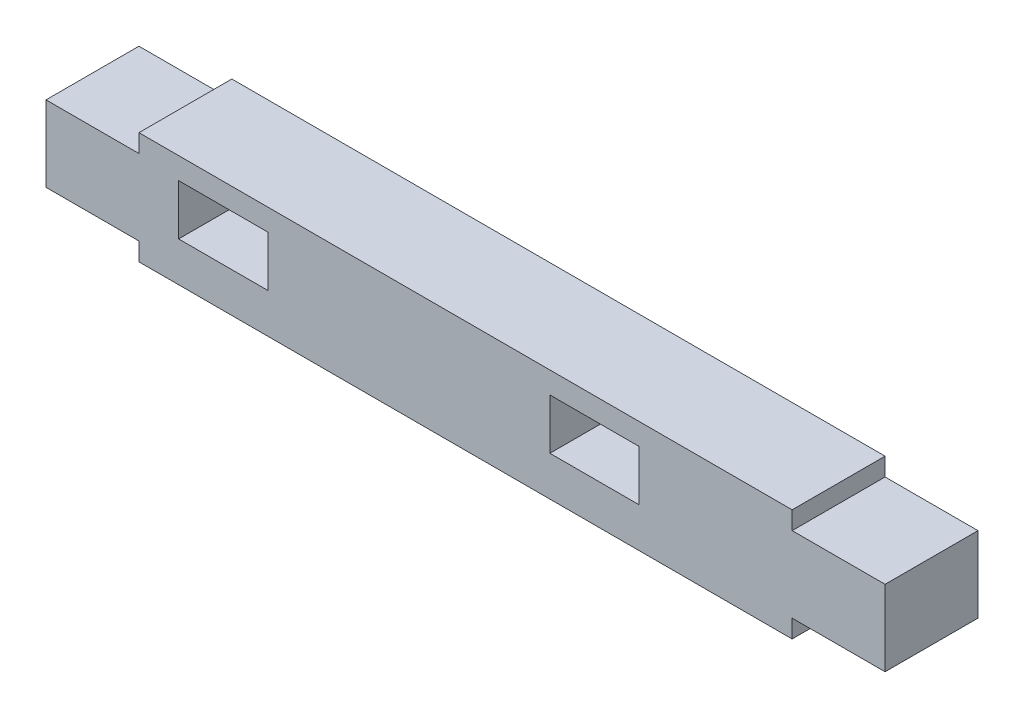
ISO-10303-21;
HEADER;
FILE_DESCRIPTION(('STEP AP214'),'2;1');
FILE_NAME('part.step','',(''),(''),'','','');
FILE_SCHEMA(('AUTOMOTIVE_DESIGN { 1 0 10303 214 1 1 1 1 }'));
ENDSEC;
DATA;
#1=APPLICATION_CONTEXT('core data for automotive mechanical design processes');
#2=APPLICATION_PROTOCOL_DEFINITION('international standard','automotive_design',2000,#1);
#3=PRODUCT_CONTEXT('',#1,'mechanical');
#4=PRODUCT('Part','Part','',(#3));
#5=PRODUCT_RELATED_PRODUCT_CATEGORY('part','',(#4));
#6=PRODUCT_DEFINITION_FORMATION('','',#4);
#7=PRODUCT_DEFINITION_CONTEXT('part definition',#1,'design');
#8=PRODUCT_DEFINITION('design','',#6,#7);
#9=PRODUCT_DEFINITION_SHAPE('','',#8);
#10=(LENGTH_UNIT() NAMED_UNIT(*) SI_UNIT(.MILLI.,.METRE.));
#11=(NAMED_UNIT(*) PLANE_ANGLE_UNIT() SI_UNIT($,.RADIAN.));
#12=(NAMED_UNIT(*) SI_UNIT($,.STERADIAN.) SOLID_ANGLE_UNIT());
#13=UNCERTAINTY_MEASURE_WITH_UNIT(LENGTH_MEASURE(1.E-05),#10,'distance_accuracy_value','');
#14=(GEOMETRIC_REPRESENTATION_CONTEXT(3) GLOBAL_UNCERTAINTY_ASSIGNED_CONTEXT((#13)) GLOBAL_UNIT_ASSIGNED_CONTEXT((#10,
#11,#12)) REPRESENTATION_CONTEXT('',''));
#15=CARTESIAN_POINT('',(0.,0.,0.));
#16=DIRECTION('',(0.,0.,1.));
#17=DIRECTION('',(1.,0.,0.));
#18=AXIS2_PLACEMENT_3D('',#15,#16,#17);
#19=CARTESIAN_POINT('',(-18.1,6.1,5.15));
#20=DIRECTION('',(1.,0.,0.));
#21=DIRECTION('',(0.,0.,-1.));
#22=AXIS2_PLACEMENT_3D('',#19,#20,#21);
#23=PLANE('',#22);
#24=DIRECTION('',(0.,-1.,0.));
#25=VECTOR('',#24,1.);
#26=CARTESIAN_POINT('',(-18.1,6.1,0.));
#27=LINE('',#26,#25);
#28=CARTESIAN_POINT('',(-18.1,6.1,0.));
#29=VERTEX_POINT('',#28);
#30=CARTESIAN_POINT('',(-18.1,5.1,0.));
#31=VERTEX_POINT('',#30);
#32=EDGE_CURVE('E248',#29,#31,#27,.T.);
#33=ORIENTED_EDGE('',*,*,#32,.T.);
#34=DIRECTION('',(0.,0.,-1.));
#35=VECTOR('',#34,1.);
#36=CARTESIAN_POINT('',(-18.1,5.1,5.15));
#37=LINE('',#36,#35);
#38=CARTESIAN_POINT('',(-18.1,5.1,5.15));
#39=VERTEX_POINT('',#38);
#40=EDGE_CURVE('E12',#39,#31,#37,.T.);
#41=ORIENTED_EDGE('',*,*,#40,.F.);
#42=DIRECTION('',(0.,-1.,0.));
#43=VECTOR('',#42,1.);
#44=CARTESIAN_POINT('',(-18.1,6.1,5.15));
#45=LINE('',#44,#43);
#46=CARTESIAN_POINT('',(-18.1,6.1,5.15));
#47=VERTEX_POINT('',#46);
#48=EDGE_CURVE('E255',#47,#39,#45,.T.);
#49=ORIENTED_EDGE('',*,*,#48,.F.);
#50=DIRECTION('',(0.,0.,-1.));
#51=VECTOR('',#50,1.);
#52=CARTESIAN_POINT('',(-18.1,6.1,5.15));
#53=LINE('',#52,#51);
#54=EDGE_CURVE('E301',#47,#29,#53,.T.);
#55=ORIENTED_EDGE('',*,*,#54,.T.);
#56=EDGE_LOOP('',(#33,#41,#49,#55));
#57=FACE_BOUND('',#56,.T.);
#58=ADVANCED_FACE('F36',(#57),#23,.F.);
#59=CARTESIAN_POINT('',(-18.1,5.1,5.15));
#60=DIRECTION('',(0.,-1.,0.));
#61=DIRECTION('',(0.,0.,-1.));
#62=AXIS2_PLACEMENT_3D('',#59,#60,#61);
#63=PLANE('',#62);
#64=DIRECTION('',(-1.,0.,0.));
#65=VECTOR('',#64,1.);
#66=CARTESIAN_POINT('',(-18.1,5.1,0.));
#67=LINE('',#66,#65);
#68=CARTESIAN_POINT('',(-23.25,5.1,0.));
#69=VERTEX_POINT('',#68);
#70=EDGE_CURVE('E304',#31,#69,#67,.T.);
#71=ORIENTED_EDGE('',*,*,#70,.T.);
#72=DIRECTION('',(0.,0.,-1.));
#73=VECTOR('',#72,1.);
#74=CARTESIAN_POINT('',(-23.25,5.1,5.15));
#75=LINE('',#74,#73);
#76=CARTESIAN_POINT('',(-23.25,5.1,5.15));
#77=VERTEX_POINT('',#76);
#78=EDGE_CURVE('E43',#77,#69,#75,.T.);
#79=ORIENTED_EDGE('',*,*,#78,.F.);
#80=DIRECTION('',(-1.,0.,0.));
#81=VECTOR('',#80,1.);
#82=CARTESIAN_POINT('',(-18.1,5.1,5.15));
#83=LINE('',#82,#81);
#84=EDGE_CURVE('E259',#39,#77,#83,.T.);
#85=ORIENTED_EDGE('',*,*,#84,.F.);
#86=ORIENTED_EDGE('',*,*,#40,.T.);
#87=EDGE_LOOP('',(#71,#79,#85,#86));
#88=FACE_BOUND('',#87,.T.);
#89=ADVANCED_FACE('F380',(#88),#63,.F.);
#90=CARTESIAN_POINT('',(-23.25,5.1,5.15));
#91=DIRECTION('',(1.,0.,0.));
#92=DIRECTION('',(0.,0.,-1.));
#93=AXIS2_PLACEMENT_3D('',#90,#91,#92);
#94=PLANE('',#93);
#95=DIRECTION('',(0.,-1.,0.));
#96=VECTOR('',#95,1.);
#97=CARTESIAN_POINT('',(-23.25,5.1,0.));
#98=LINE('',#97,#96);
#99=CARTESIAN_POINT('',(-23.25,0.899999999999995,0.));
#100=VERTEX_POINT('',#99);
#101=EDGE_CURVE('E306',#69,#100,#98,.T.);
#102=ORIENTED_EDGE('',*,*,#101,.T.);
#103=DIRECTION('',(0.,0.,-1.));
#104=VECTOR('',#103,1.);
#105=CARTESIAN_POINT('',(-23.25,0.899999999999995,5.15));
#106=LINE('',#105,#104);
#107=CARTESIAN_POINT('',(-23.25,0.899999999999995,5.15));
#108=VERTEX_POINT('',#107);
#109=EDGE_CURVE('E351',#108,#100,#106,.T.);
#110=ORIENTED_EDGE('',*,*,#109,.F.);
#111=DIRECTION('',(0.,-1.,0.));
#112=VECTOR('',#111,1.);
#113=CARTESIAN_POINT('',(-23.25,5.1,5.15));
#114=LINE('',#113,#112);
#115=EDGE_CURVE('E268',#77,#108,#114,.T.);
#116=ORIENTED_EDGE('',*,*,#115,.F.);
#117=ORIENTED_EDGE('',*,*,#78,.T.);
#118=EDGE_LOOP('',(#102,#110,#116,#117));
#119=FACE_BOUND('',#118,.T.);
#120=ADVANCED_FACE('F358',(#119),#94,.F.);
#121=CARTESIAN_POINT('',(-23.25,0.899999999999995,5.15));
#122=DIRECTION('',(0.,1.,0.));
#123=DIRECTION('',(-1.,0.,0.));
#124=AXIS2_PLACEMENT_3D('',#121,#122,#123);
#125=PLANE('',#124);
#126=DIRECTION('',(1.,0.,0.));
#127=VECTOR('',#126,1.);
#128=CARTESIAN_POINT('',(-23.25,0.899999999999995,0.));
#129=LINE('',#128,#127);
#130=CARTESIAN_POINT('',(-18.1,0.899999999999995,0.));
#131=VERTEX_POINT('',#130);
#132=EDGE_CURVE('E308',#100,#131,#129,.T.);
#133=ORIENTED_EDGE('',*,*,#132,.T.);
#134=DIRECTION('',(0.,0.,-1.));
#135=VECTOR('',#134,1.);
#136=CARTESIAN_POINT('',(-18.1,0.899999999999995,5.15));
#137=LINE('',#136,#135);
#138=CARTESIAN_POINT('',(-18.1,0.899999999999995,5.15));
#139=VERTEX_POINT('',#138);
#140=EDGE_CURVE('E348',#139,#131,#137,.T.);
#141=ORIENTED_EDGE('',*,*,#140,.F.);
#142=DIRECTION('',(1.,0.,0.));
#143=VECTOR('',#142,1.);
#144=CARTESIAN_POINT('',(-23.25,0.899999999999995,5.15));
#145=LINE('',#144,#143);
#146=EDGE_CURVE('E270',#108,#139,#145,.T.);
#147=ORIENTED_EDGE('',*,*,#146,.F.);
#148=ORIENTED_EDGE('',*,*,#109,.T.);
#149=EDGE_LOOP('',(#133,#141,#147,#148));
#150=FACE_BOUND('',#149,.T.);
#151=ADVANCED_FACE('F368',(#150),#125,.F.);
#152=CARTESIAN_POINT('',(-18.1,0.899999999999995,5.15));
#153=DIRECTION('',(1.,0.,0.));
#154=DIRECTION('',(0.,0.,-1.));
#155=AXIS2_PLACEMENT_3D('',#152,#153,#154);
#156=PLANE('',#155);
#157=DIRECTION('',(0.,-1.,0.));
#158=VECTOR('',#157,1.);
#159=CARTESIAN_POINT('',(-18.1,0.899999999999995,0.));
#160=LINE('',#159,#158);
#161=CARTESIAN_POINT('',(-18.1,-0.1,0.));
#162=VERTEX_POINT('',#161);
#163=EDGE_CURVE('E310',#131,#162,#160,.T.);
#164=ORIENTED_EDGE('',*,*,#163,.T.);
#165=DIRECTION('',(0.,0.,-1.));
#166=VECTOR('',#165,1.);
#167=CARTESIAN_POINT('',(-18.1,-0.1,5.15));
#168=LINE('',#167,#166);
#169=CARTESIAN_POINT('',(-18.1,-0.1,5.15));
#170=VERTEX_POINT('',#169);
#171=EDGE_CURVE('E345',#170,#162,#168,.T.);
#172=ORIENTED_EDGE('',*,*,#171,.F.);
#173=DIRECTION('',(0.,-1.,0.));
#174=VECTOR('',#173,1.);
#175=CARTESIAN_POINT('',(-18.1,0.899999999999995,5.15));
#176=LINE('',#175,#174);
#177=EDGE_CURVE('E273',#139,#170,#176,.T.);
#178=ORIENTED_EDGE('',*,*,#177,.F.);
#179=ORIENTED_EDGE('',*,*,#140,.T.);
#180=EDGE_LOOP('',(#164,#172,#178,#179));
#181=FACE_BOUND('',#180,.T.);
#182=ADVANCED_FACE('F372',(#181),#156,.F.);
#183=CARTESIAN_POINT('',(18.1,-0.1,5.15));
#184=DIRECTION('',(0.,1.,0.));
#185=DIRECTION('',(-1.,0.,0.));
#186=AXIS2_PLACEMENT_3D('',#183,#184,#185);
#187=PLANE('',#186);
#188=DIRECTION('',(1.,0.,0.));
#189=VECTOR('',#188,1.);
#190=CARTESIAN_POINT('',(18.1,-0.1,0.));
#191=LINE('',#190,#189);
#192=CARTESIAN_POINT('',(18.1,-0.1,0.));
#193=VERTEX_POINT('',#192);
#194=EDGE_CURVE('E312',#162,#193,#191,.T.);
#195=ORIENTED_EDGE('',*,*,#194,.T.);
#196=DIRECTION('',(0.,0.,-1.));
#197=VECTOR('',#196,1.);
#198=CARTESIAN_POINT('',(18.1,-0.1,5.15));
#199=LINE('',#198,#197);
#200=CARTESIAN_POINT('',(18.1,-0.1,5.15));
#201=VERTEX_POINT('',#200);
#202=EDGE_CURVE('E342',#201,#193,#199,.T.);
#203=ORIENTED_EDGE('',*,*,#202,.F.);
#204=DIRECTION('',(1.,0.,0.));
#205=VECTOR('',#204,1.);
#206=CARTESIAN_POINT('',(18.1,-0.1,5.15));
#207=LINE('',#206,#205);
#208=EDGE_CURVE('E276',#170,#201,#207,.T.);
#209=ORIENTED_EDGE('',*,*,#208,.F.);
#210=ORIENTED_EDGE('',*,*,#171,.T.);
#211=EDGE_LOOP('',(#195,#203,#209,#210));
#212=FACE_BOUND('',#211,.T.);
#213=ADVANCED_FACE('F413',(#212),#187,.F.);
#214=CARTESIAN_POINT('',(18.1,0.9,5.15));
#215=DIRECTION('',(-1.,0.,0.));
#216=DIRECTION('',(0.,0.,1.));
#217=AXIS2_PLACEMENT_3D('',#214,#215,#216);
#218=PLANE('',#217);
#219=DIRECTION('',(0.,1.,0.));
#220=VECTOR('',#219,1.);
#221=CARTESIAN_POINT('',(18.1,0.9,0.));
#222=LINE('',#221,#220);
#223=CARTESIAN_POINT('',(18.1,0.9,0.));
#224=VERTEX_POINT('',#223);
#225=EDGE_CURVE('E314',#193,#224,#222,.T.);
#226=ORIENTED_EDGE('',*,*,#225,.T.);
#227=DIRECTION('',(0.,0.,-1.));
#228=VECTOR('',#227,1.);
#229=CARTESIAN_POINT('',(18.1,0.9,5.15));
#230=LINE('',#229,#228);
#231=CARTESIAN_POINT('',(18.1,0.9,5.15));
#232=VERTEX_POINT('',#231);
#233=EDGE_CURVE('E339',#232,#224,#230,.T.);
#234=ORIENTED_EDGE('',*,*,#233,.F.);
#235=DIRECTION('',(0.,1.,0.));
#236=VECTOR('',#235,1.);
#237=CARTESIAN_POINT('',(18.1,0.9,5.15));
#238=LINE('',#237,#236);
#239=EDGE_CURVE('E284',#201,#232,#238,.T.);
#240=ORIENTED_EDGE('',*,*,#239,.F.);
#241=ORIENTED_EDGE('',*,*,#202,.T.);
#242=EDGE_LOOP('',(#226,#234,#240,#241));
#243=FACE_BOUND('',#242,.T.);
#244=ADVANCED_FACE('F411',(#243),#218,.F.);
#245=CARTESIAN_POINT('',(23.25,0.9,5.15));
#246=DIRECTION('',(0.,1.,0.));
#247=DIRECTION('',(0.,0.,1.));
#248=AXIS2_PLACEMENT_3D('',#245,#246,#247);
#249=PLANE('',#248);
#250=DIRECTION('',(1.,0.,0.));
#251=VECTOR('',#250,1.);
#252=CARTESIAN_POINT('',(23.25,0.9,0.));
#253=LINE('',#252,#251);
#254=CARTESIAN_POINT('',(23.25,0.9,0.));
#255=VERTEX_POINT('',#254);
#256=EDGE_CURVE('E316',#224,#255,#253,.T.);
#257=ORIENTED_EDGE('',*,*,#256,.T.);
#258=DIRECTION('',(0.,0.,-1.));
#259=VECTOR('',#258,1.);
#260=CARTESIAN_POINT('',(23.25,0.9,5.15));
#261=LINE('',#260,#259);
#262=CARTESIAN_POINT('',(23.25,0.9,5.15));
#263=VERTEX_POINT('',#262);
#264=EDGE_CURVE('E336',#263,#255,#261,.T.);
#265=ORIENTED_EDGE('',*,*,#264,.F.);
#266=DIRECTION('',(1.,0.,0.));
#267=VECTOR('',#266,1.);
#268=CARTESIAN_POINT('',(23.25,0.9,5.15));
#269=LINE('',#268,#267);
#270=EDGE_CURVE('E286',#232,#263,#269,.T.);
#271=ORIENTED_EDGE('',*,*,#270,.F.);
#272=ORIENTED_EDGE('',*,*,#233,.T.);
#273=EDGE_LOOP('',(#257,#265,#271,#272));
#274=FACE_BOUND('',#273,.T.);
#275=ADVANCED_FACE('F407',(#274),#249,.F.);
#276=CARTESIAN_POINT('',(23.25,5.1,5.15));
#277=DIRECTION('',(-1.,0.,0.));
#278=DIRECTION('',(0.,0.,1.));
#279=AXIS2_PLACEMENT_3D('',#276,#277,#278);
#280=PLANE('',#279);
#281=DIRECTION('',(0.,1.,0.));
#282=VECTOR('',#281,1.);
#283=CARTESIAN_POINT('',(23.25,5.1,0.));
#284=LINE('',#283,#282);
#285=CARTESIAN_POINT('',(23.25,5.1,0.));
#286=VERTEX_POINT('',#285);
#287=EDGE_CURVE('E318',#255,#286,#284,.T.);
#288=ORIENTED_EDGE('',*,*,#287,.T.);
#289=DIRECTION('',(0.,0.,-1.));
#290=VECTOR('',#289,1.);
#291=CARTESIAN_POINT('',(23.25,5.1,5.15));
#292=LINE('',#291,#290);
#293=CARTESIAN_POINT('',(23.25,5.1,5.15));
#294=VERTEX_POINT('',#293);
#295=EDGE_CURVE('E333',#294,#286,#292,.T.);
#296=ORIENTED_EDGE('',*,*,#295,.F.);
#297=DIRECTION('',(0.,1.,0.));
#298=VECTOR('',#297,1.);
#299=CARTESIAN_POINT('',(23.25,5.1,5.15));
#300=LINE('',#299,#298);
#301=EDGE_CURVE('E289',#263,#294,#300,.T.);
#302=ORIENTED_EDGE('',*,*,#301,.F.);
#303=ORIENTED_EDGE('',*,*,#264,.T.);
#304=EDGE_LOOP('',(#288,#296,#302,#303));
#305=FACE_BOUND('',#304,.T.);
#306=ADVANCED_FACE('F402',(#305),#280,.F.);
#307=CARTESIAN_POINT('',(18.1,5.1,5.15));
#308=DIRECTION('',(0.,-1.,0.));
#309=DIRECTION('',(0.,0.,-1.));
#310=AXIS2_PLACEMENT_3D('',#307,#308,#309);
#311=PLANE('',#310);
#312=DIRECTION('',(-1.,0.,0.));
#313=VECTOR('',#312,1.);
#314=CARTESIAN_POINT('',(18.1,5.1,0.));
#315=LINE('',#314,#313);
#316=CARTESIAN_POINT('',(18.1,5.1,0.));
#317=VERTEX_POINT('',#316);
#318=EDGE_CURVE('E320',#286,#317,#315,.T.);
#319=ORIENTED_EDGE('',*,*,#318,.T.);
#320=DIRECTION('',(0.,0.,-1.));
#321=VECTOR('',#320,1.);
#322=CARTESIAN_POINT('',(18.1,5.1,5.15));
#323=LINE('',#322,#321);
#324=CARTESIAN_POINT('',(18.1,5.1,5.15));
#325=VERTEX_POINT('',#324);
#326=EDGE_CURVE('E330',#325,#317,#323,.T.);
#327=ORIENTED_EDGE('',*,*,#326,.F.);
#328=DIRECTION('',(-1.,0.,0.));
#329=VECTOR('',#328,1.);
#330=CARTESIAN_POINT('',(18.1,5.1,5.15));
#331=LINE('',#330,#329);
#332=EDGE_CURVE('E292',#294,#325,#331,.T.);
#333=ORIENTED_EDGE('',*,*,#332,.F.);
#334=ORIENTED_EDGE('',*,*,#295,.T.);
#335=EDGE_LOOP('',(#319,#327,#333,#334));
#336=FACE_BOUND('',#335,.T.);
#337=ADVANCED_FACE('F396',(#336),#311,.F.);
#338=CARTESIAN_POINT('',(18.1,6.1,5.15));
#339=DIRECTION('',(-1.,0.,0.));
#340=DIRECTION('',(0.,0.,1.));
#341=AXIS2_PLACEMENT_3D('',#338,#339,#340);
#342=PLANE('',#341);
#343=DIRECTION('',(0.,1.,0.));
#344=VECTOR('',#343,1.);
#345=CARTESIAN_POINT('',(18.1,6.1,0.));
#346=LINE('',#345,#344);
#347=CARTESIAN_POINT('',(18.1,6.1,0.));
#348=VERTEX_POINT('',#347);
#349=EDGE_CURVE('E322',#317,#348,#346,.T.);
#350=ORIENTED_EDGE('',*,*,#349,.T.);
#351=DIRECTION('',(0.,0.,-1.));
#352=VECTOR('',#351,1.);
#353=CARTESIAN_POINT('',(18.1,6.1,5.15));
#354=LINE('',#353,#352);
#355=CARTESIAN_POINT('',(18.1,6.1,5.15));
#356=VERTEX_POINT('',#355);
#357=EDGE_CURVE('E327',#356,#348,#354,.T.);
#358=ORIENTED_EDGE('',*,*,#357,.F.);
#359=DIRECTION('',(0.,1.,0.));
#360=VECTOR('',#359,1.);
#361=CARTESIAN_POINT('',(18.1,6.1,5.15));
#362=LINE('',#361,#360);
#363=EDGE_CURVE('E296',#325,#356,#362,.T.);
#364=ORIENTED_EDGE('',*,*,#363,.F.);
#365=ORIENTED_EDGE('',*,*,#326,.T.);
#366=EDGE_LOOP('',(#350,#358,#364,#365));
#367=FACE_BOUND('',#366,.T.);
#368=ADVANCED_FACE('F392',(#367),#342,.F.);
#369=CARTESIAN_POINT('',(-18.1,6.1,5.15));
#370=DIRECTION('',(0.,-1.,0.));
#371=DIRECTION('',(0.,0.,-1.));
#372=AXIS2_PLACEMENT_3D('',#369,#370,#371);
#373=PLANE('',#372);
#374=DIRECTION('',(-1.,0.,0.));
#375=VECTOR('',#374,1.);
#376=CARTESIAN_POINT('',(-18.1,6.1,0.));
#377=LINE('',#376,#375);
#378=EDGE_CURVE('E260',#348,#29,#377,.T.);
#379=ORIENTED_EDGE('',*,*,#378,.T.);
#380=ORIENTED_EDGE('',*,*,#54,.F.);
#381=DIRECTION('',(-1.,0.,0.));
#382=VECTOR('',#381,1.);
#383=CARTESIAN_POINT('',(-18.1,6.1,5.15));
#384=LINE('',#383,#382);
#385=EDGE_CURVE('E298',#356,#47,#384,.T.);
#386=ORIENTED_EDGE('',*,*,#385,.F.);
#387=ORIENTED_EDGE('',*,*,#357,.T.);
#388=EDGE_LOOP('',(#379,#380,#386,#387));
#389=FACE_BOUND('',#388,.T.);
#390=ADVANCED_FACE('F387',(#389),#373,.F.);
#391=CARTESIAN_POINT('',(-18.1,5.1,5.15));
#392=DIRECTION('',(0.,0.,-1.));
#393=DIRECTION('',(-1.,0.,0.));
#394=AXIS2_PLACEMENT_3D('',#391,#392,#393);
#395=PLANE('',#394);
#396=DIRECTION('',(1.,0.,0.));
#397=VECTOR('',#396,1.);
#398=CARTESIAN_POINT('',(-15.9,2.1,5.15));
#399=LINE('',#398,#397);
#400=CARTESIAN_POINT('',(-15.9,2.1,5.15));
#401=VERTEX_POINT('',#400);
#402=CARTESIAN_POINT('',(-10.95,2.1,5.15));
#403=VERTEX_POINT('',#402);
#404=EDGE_CURVE('E200',#401,#403,#399,.T.);
#405=ORIENTED_EDGE('',*,*,#404,.F.);
#406=DIRECTION('',(0.,-1.,0.));
#407=VECTOR('',#406,1.);
#408=CARTESIAN_POINT('',(-15.9,4.9,5.15));
#409=LINE('',#408,#407);
#410=CARTESIAN_POINT('',(-15.9,4.9,5.15));
#411=VERTEX_POINT('',#410);
#412=EDGE_CURVE('E50',#411,#401,#409,.T.);
#413=ORIENTED_EDGE('',*,*,#412,.F.);
#414=DIRECTION('',(-1.,0.,0.));
#415=VECTOR('',#414,1.);
#416=CARTESIAN_POINT('',(-15.9,4.9,5.15));
#417=LINE('',#416,#415);
#418=CARTESIAN_POINT('',(-10.95,4.9,5.15));
#419=VERTEX_POINT('',#418);
#420=EDGE_CURVE('E190',#419,#411,#417,.T.);
#421=ORIENTED_EDGE('',*,*,#420,.F.);
#422=DIRECTION('',(0.,1.,0.));
#423=VECTOR('',#422,1.);
#424=CARTESIAN_POINT('',(-10.95,4.9,5.15));
#425=LINE('',#424,#423);
#426=EDGE_CURVE('E193',#403,#419,#425,.T.);
#427=ORIENTED_EDGE('',*,*,#426,.F.);
#428=EDGE_LOOP('',(#405,#413,#421,#427));
#429=FACE_BOUND('',#428,.T.);
#430=DIRECTION('',(1.,0.,0.));
#431=VECTOR('',#430,1.);
#432=CARTESIAN_POINT('',(4.675,2.1,5.15));
#433=LINE('',#432,#431);
#434=CARTESIAN_POINT('',(4.675,2.1,5.15));
#435=VERTEX_POINT('',#434);
#436=CARTESIAN_POINT('',(9.625,2.1,5.15));
#437=VERTEX_POINT('',#436);
#438=EDGE_CURVE('E233',#435,#437,#433,.T.);
#439=ORIENTED_EDGE('',*,*,#438,.F.);
#440=DIRECTION('',(0.,-1.,0.));
#441=VECTOR('',#440,1.);
#442=CARTESIAN_POINT('',(4.675,4.9,5.15));
#443=LINE('',#442,#441);
#444=CARTESIAN_POINT('',(4.675,4.9,5.15));
#445=VERTEX_POINT('',#444);
#446=EDGE_CURVE('E213',#445,#435,#443,.T.);
#447=ORIENTED_EDGE('',*,*,#446,.F.);
#448=DIRECTION('',(-1.,0.,0.));
#449=VECTOR('',#448,1.);
#450=CARTESIAN_POINT('',(4.675,4.9,5.15));
#451=LINE('',#450,#449);
#452=CARTESIAN_POINT('',(9.625,4.9,5.15));
#453=VERTEX_POINT('',#452);
#454=EDGE_CURVE('E221',#453,#445,#451,.T.);
#455=ORIENTED_EDGE('',*,*,#454,.F.);
#456=DIRECTION('',(0.,1.,0.));
#457=VECTOR('',#456,1.);
#458=CARTESIAN_POINT('',(9.625,4.9,5.15));
#459=LINE('',#458,#457);
#460=EDGE_CURVE('E244',#437,#453,#459,.T.);
#461=ORIENTED_EDGE('',*,*,#460,.F.);
#462=EDGE_LOOP('',(#439,#447,#455,#461));
#463=FACE_BOUND('',#462,.T.);
#464=ORIENTED_EDGE('',*,*,#48,.T.);
#465=ORIENTED_EDGE('',*,*,#84,.T.);
#466=ORIENTED_EDGE('',*,*,#115,.T.);
#467=ORIENTED_EDGE('',*,*,#146,.T.);
#468=ORIENTED_EDGE('',*,*,#177,.T.);
#469=ORIENTED_EDGE('',*,*,#208,.T.);
#470=ORIENTED_EDGE('',*,*,#239,.T.);
#471=ORIENTED_EDGE('',*,*,#270,.T.);
#472=ORIENTED_EDGE('',*,*,#301,.T.);
#473=ORIENTED_EDGE('',*,*,#332,.T.);
#474=ORIENTED_EDGE('',*,*,#363,.T.);
#475=ORIENTED_EDGE('',*,*,#385,.T.);
#476=EDGE_LOOP('',(#464,#465,#466,#467,#468,#469,#470,#471,#472,#473,#474,#475));
#477=FACE_BOUND('',#476,.T.);
#478=ADVANCED_FACE('F376',(#429,#463,#477),#395,.F.);
#479=CARTESIAN_POINT('',(-18.1,5.1,0.));
#480=DIRECTION('',(0.,0.,-1.));
#481=DIRECTION('',(-1.,0.,0.));
#482=AXIS2_PLACEMENT_3D('',#479,#480,#481);
#483=PLANE('',#482);
#484=DIRECTION('',(0.,-1.,0.));
#485=VECTOR('',#484,1.);
#486=CARTESIAN_POINT('',(-15.9,4.9,0.));
#487=LINE('',#486,#485);
#488=CARTESIAN_POINT('',(-15.9,4.9,0.));
#489=VERTEX_POINT('',#488);
#490=CARTESIAN_POINT('',(-15.9,2.1,0.));
#491=VERTEX_POINT('',#490);
#492=EDGE_CURVE('E174',#489,#491,#487,.T.);
#493=ORIENTED_EDGE('',*,*,#492,.T.);
#494=DIRECTION('',(1.,0.,0.));
#495=VECTOR('',#494,1.);
#496=CARTESIAN_POINT('',(-15.9,2.1,0.));
#497=LINE('',#496,#495);
#498=CARTESIAN_POINT('',(-10.95,2.1,0.));
#499=VERTEX_POINT('',#498);
#500=EDGE_CURVE('E183',#491,#499,#497,.T.);
#501=ORIENTED_EDGE('',*,*,#500,.T.);
#502=DIRECTION('',(0.,1.,0.));
#503=VECTOR('',#502,1.);
#504=CARTESIAN_POINT('',(-10.95,4.9,0.));
#505=LINE('',#504,#503);
#506=CARTESIAN_POINT('',(-10.95,4.9,0.));
#507=VERTEX_POINT('',#506);
#508=EDGE_CURVE('E58',#499,#507,#505,.T.);
#509=ORIENTED_EDGE('',*,*,#508,.T.);
#510=DIRECTION('',(-1.,0.,0.));
#511=VECTOR('',#510,1.);
#512=CARTESIAN_POINT('',(-15.9,4.9,0.));
#513=LINE('',#512,#511);
#514=EDGE_CURVE('E180',#507,#489,#513,.T.);
#515=ORIENTED_EDGE('',*,*,#514,.T.);
#516=EDGE_LOOP('',(#493,#501,#509,#515));
#517=FACE_BOUND('',#516,.T.);
#518=DIRECTION('',(0.,-1.,0.));
#519=VECTOR('',#518,1.);
#520=CARTESIAN_POINT('',(4.675,4.9,0.));
#521=LINE('',#520,#519);
#522=CARTESIAN_POINT('',(4.675,4.9,0.));
#523=VERTEX_POINT('',#522);
#524=CARTESIAN_POINT('',(4.675,2.1,0.));
#525=VERTEX_POINT('',#524);
#526=EDGE_CURVE('E217',#523,#525,#521,.T.);
#527=ORIENTED_EDGE('',*,*,#526,.T.);
#528=DIRECTION('',(1.,0.,0.));
#529=VECTOR('',#528,1.);
#530=CARTESIAN_POINT('',(4.675,2.1,0.));
#531=LINE('',#530,#529);
#532=CARTESIAN_POINT('',(9.62499999999999,2.1,0.));
#533=VERTEX_POINT('',#532);
#534=EDGE_CURVE('E220',#525,#533,#531,.T.);
#535=ORIENTED_EDGE('',*,*,#534,.T.);
#536=DIRECTION('',(0.,1.,0.));
#537=VECTOR('',#536,1.);
#538=CARTESIAN_POINT('',(9.625,4.9,0.));
#539=LINE('',#538,#537);
#540=CARTESIAN_POINT('',(9.625,4.9,0.));
#541=VERTEX_POINT('',#540);
#542=EDGE_CURVE('E224',#533,#541,#539,.T.);
#543=ORIENTED_EDGE('',*,*,#542,.T.);
#544=DIRECTION('',(-1.,0.,0.));
#545=VECTOR('',#544,1.);
#546=CARTESIAN_POINT('',(4.675,4.9,0.));
#547=LINE('',#546,#545);
#548=EDGE_CURVE('E227',#541,#523,#547,.T.);
#549=ORIENTED_EDGE('',*,*,#548,.T.);
#550=EDGE_LOOP('',(#527,#535,#543,#549));
#551=FACE_BOUND('',#550,.T.);
#552=ORIENTED_EDGE('',*,*,#32,.F.);
#553=ORIENTED_EDGE('',*,*,#378,.F.);
#554=ORIENTED_EDGE('',*,*,#349,.F.);
#555=ORIENTED_EDGE('',*,*,#318,.F.);
#556=ORIENTED_EDGE('',*,*,#287,.F.);
#557=ORIENTED_EDGE('',*,*,#256,.F.);
#558=ORIENTED_EDGE('',*,*,#225,.F.);
#559=ORIENTED_EDGE('',*,*,#194,.F.);
#560=ORIENTED_EDGE('',*,*,#163,.F.);
#561=ORIENTED_EDGE('',*,*,#132,.F.);
#562=ORIENTED_EDGE('',*,*,#101,.F.);
#563=ORIENTED_EDGE('',*,*,#70,.F.);
#564=EDGE_LOOP('',(#552,#553,#554,#555,#556,#557,#558,#559,#560,#561,#562,#563));
#565=FACE_BOUND('',#564,.T.);
#566=ADVANCED_FACE('F187',(#517,#551,#565),#483,.T.);
#567=CARTESIAN_POINT('',(4.675,4.9,0.));
#568=DIRECTION('',(-1.,0.,0.));
#569=DIRECTION('',(0.,0.,1.));
#570=AXIS2_PLACEMENT_3D('',#567,#568,#569);
#571=PLANE('',#570);
#572=ORIENTED_EDGE('',*,*,#446,.T.);
#573=DIRECTION('',(0.,0.,1.));
#574=VECTOR('',#573,1.);
#575=CARTESIAN_POINT('',(4.675,2.1,0.));
#576=LINE('',#575,#574);
#577=EDGE_CURVE('E230',#525,#435,#576,.T.);
#578=ORIENTED_EDGE('',*,*,#577,.F.);
#579=ORIENTED_EDGE('',*,*,#526,.F.);
#580=DIRECTION('',(0.,0.,1.));
#581=VECTOR('',#580,1.);
#582=CARTESIAN_POINT('',(4.675,4.9,0.));
#583=LINE('',#582,#581);
#584=EDGE_CURVE('E246',#523,#445,#583,.T.);
#585=ORIENTED_EDGE('',*,*,#584,.T.);
#586=EDGE_LOOP('',(#572,#578,#579,#585));
#587=FACE_BOUND('',#586,.T.);
#588=ADVANCED_FACE('F508',(#587),#571,.F.);
#589=CARTESIAN_POINT('',(4.675,4.9,0.));
#590=DIRECTION('',(0.,1.,0.));
#591=DIRECTION('',(0.,0.,1.));
#592=AXIS2_PLACEMENT_3D('',#589,#590,#591);
#593=PLANE('',#592);
#594=ORIENTED_EDGE('',*,*,#454,.T.);
#595=ORIENTED_EDGE('',*,*,#584,.F.);
#596=ORIENTED_EDGE('',*,*,#548,.F.);
#597=DIRECTION('',(0.,0.,1.));
#598=VECTOR('',#597,1.);
#599=CARTESIAN_POINT('',(9.625,4.9,0.));
#600=LINE('',#599,#598);
#601=EDGE_CURVE('E249',#541,#453,#600,.T.);
#602=ORIENTED_EDGE('',*,*,#601,.T.);
#603=EDGE_LOOP('',(#594,#595,#596,#602));
#604=FACE_BOUND('',#603,.T.);
#605=ADVANCED_FACE('F517',(#604),#593,.F.);
#606=CARTESIAN_POINT('',(9.625,4.9,0.));
#607=DIRECTION('',(1.,0.,0.));
#608=DIRECTION('',(0.,0.,-1.));
#609=AXIS2_PLACEMENT_3D('',#606,#607,#608);
#610=PLANE('',#609);
#611=ORIENTED_EDGE('',*,*,#460,.T.);
#612=ORIENTED_EDGE('',*,*,#601,.F.);
#613=ORIENTED_EDGE('',*,*,#542,.F.);
#614=DIRECTION('',(0.,0.,1.));
#615=VECTOR('',#614,1.);
#616=CARTESIAN_POINT('',(9.625,2.1,0.));
#617=LINE('',#616,#615);
#618=EDGE_CURVE('E251',#533,#437,#617,.T.);
#619=ORIENTED_EDGE('',*,*,#618,.T.);
#620=EDGE_LOOP('',(#611,#612,#613,#619));
#621=FACE_BOUND('',#620,.T.);
#622=ADVANCED_FACE('F527',(#621),#610,.F.);
#623=CARTESIAN_POINT('',(4.675,2.1,0.));
#624=DIRECTION('',(0.,-1.,0.));
#625=DIRECTION('',(0.,0.,-1.));
#626=AXIS2_PLACEMENT_3D('',#623,#624,#625);
#627=PLANE('',#626);
#628=ORIENTED_EDGE('',*,*,#438,.T.);
#629=ORIENTED_EDGE('',*,*,#618,.F.);
#630=ORIENTED_EDGE('',*,*,#534,.F.);
#631=ORIENTED_EDGE('',*,*,#577,.T.);
#632=EDGE_LOOP('',(#628,#629,#630,#631));
#633=FACE_BOUND('',#632,.T.);
#634=ADVANCED_FACE('F537',(#633),#627,.F.);
#635=CARTESIAN_POINT('',(-15.9,4.9,0.));
#636=DIRECTION('',(-1.,0.,0.));
#637=DIRECTION('',(0.,0.,1.));
#638=AXIS2_PLACEMENT_3D('',#635,#636,#637);
#639=PLANE('',#638);
#640=ORIENTED_EDGE('',*,*,#412,.T.);
#641=DIRECTION('',(0.,0.,1.));
#642=VECTOR('',#641,1.);
#643=CARTESIAN_POINT('',(-15.9,2.1,0.));
#644=LINE('',#643,#642);
#645=EDGE_CURVE('E170',#491,#401,#644,.T.);
#646=ORIENTED_EDGE('',*,*,#645,.F.);
#647=ORIENTED_EDGE('',*,*,#492,.F.);
#648=DIRECTION('',(0.,0.,1.));
#649=VECTOR('',#648,1.);
#650=CARTESIAN_POINT('',(-15.9,4.9,0.));
#651=LINE('',#650,#649);
#652=EDGE_CURVE('E211',#489,#411,#651,.T.);
#653=ORIENTED_EDGE('',*,*,#652,.T.);
#654=EDGE_LOOP('',(#640,#646,#647,#653));
#655=FACE_BOUND('',#654,.T.);
#656=ADVANCED_FACE('F172',(#655),#639,.F.);
#657=CARTESIAN_POINT('',(-15.9,4.9,0.));
#658=DIRECTION('',(0.,1.,0.));
#659=DIRECTION('',(0.,0.,1.));
#660=AXIS2_PLACEMENT_3D('',#657,#658,#659);
#661=PLANE('',#660);
#662=ORIENTED_EDGE('',*,*,#420,.T.);
#663=ORIENTED_EDGE('',*,*,#652,.F.);
#664=ORIENTED_EDGE('',*,*,#514,.F.);
#665=DIRECTION('',(0.,0.,1.));
#666=VECTOR('',#665,1.);
#667=CARTESIAN_POINT('',(-10.95,4.9,0.));
#668=LINE('',#667,#666);
#669=EDGE_CURVE('E214',#507,#419,#668,.T.);
#670=ORIENTED_EDGE('',*,*,#669,.T.);
#671=EDGE_LOOP('',(#662,#663,#664,#670));
#672=FACE_BOUND('',#671,.T.);
#673=ADVANCED_FACE('F556',(#672),#661,.F.);
#674=CARTESIAN_POINT('',(-10.95,4.9,0.));
#675=DIRECTION('',(1.,0.,0.));
#676=DIRECTION('',(0.,0.,-1.));
#677=AXIS2_PLACEMENT_3D('',#674,#675,#676);
#678=PLANE('',#677);
#679=ORIENTED_EDGE('',*,*,#426,.T.);
#680=ORIENTED_EDGE('',*,*,#669,.F.);
#681=ORIENTED_EDGE('',*,*,#508,.F.);
#682=DIRECTION('',(0.,0.,1.));
#683=VECTOR('',#682,1.);
#684=CARTESIAN_POINT('',(-10.95,2.1,0.));
#685=LINE('',#684,#683);
#686=EDGE_CURVE('E179',#499,#403,#685,.T.);
#687=ORIENTED_EDGE('',*,*,#686,.T.);
#688=EDGE_LOOP('',(#679,#680,#681,#687));
#689=FACE_BOUND('',#688,.T.);
#690=ADVANCED_FACE('F565',(#689),#678,.F.);
#691=CARTESIAN_POINT('',(-15.9,2.1,0.));
#692=DIRECTION('',(0.,-1.,0.));
#693=DIRECTION('',(0.,0.,-1.));
#694=AXIS2_PLACEMENT_3D('',#691,#692,#693);
#695=PLANE('',#694);
#696=ORIENTED_EDGE('',*,*,#404,.T.);
#697=ORIENTED_EDGE('',*,*,#686,.F.);
#698=ORIENTED_EDGE('',*,*,#500,.F.);
#699=ORIENTED_EDGE('',*,*,#645,.T.);
#700=EDGE_LOOP('',(#696,#697,#698,#699));
#701=FACE_BOUND('',#700,.T.);
#702=ADVANCED_FACE('F184',(#701),#695,.F.);
#703=CLOSED_SHELL('',(#58,#89,#120,#151,#182,#213,#244,#275,#306,#337,#368,#390,#478,#566,#588,
#605,#622,#634,#656,#673,#690,#702));
#704=MANIFOLD_SOLID_BREP('B2',#703);
#705=ADVANCED_BREP_SHAPE_REPRESENTATION('',(#18,#704),#14);
#706=SHAPE_DEFINITION_REPRESENTATION(#9,#705);
ENDSEC;
END-ISO-10303-21;
